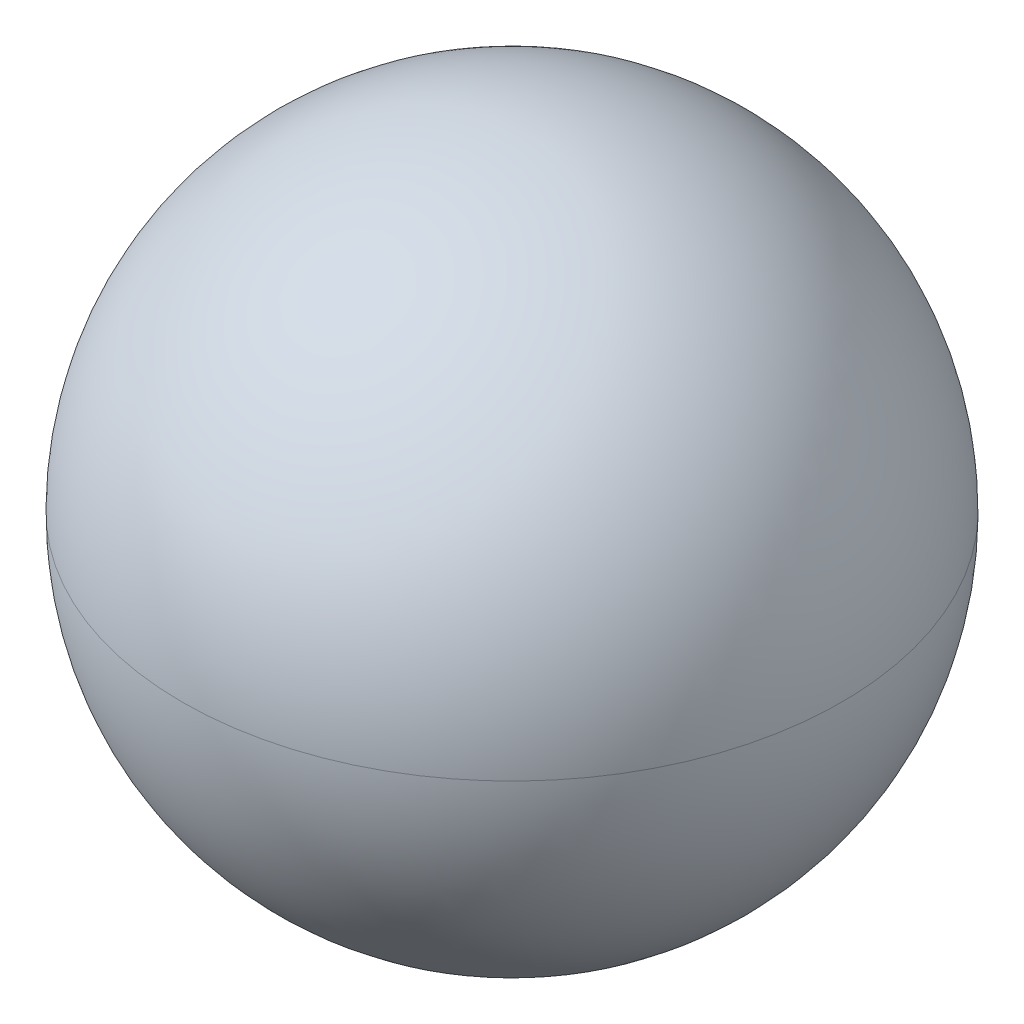
ISO-10303-21;
HEADER;
FILE_DESCRIPTION(('STEP AP214'),'2;1');
FILE_NAME('part.step','',(''),(''),'','','');
FILE_SCHEMA(('AUTOMOTIVE_DESIGN { 1 0 10303 214 1 1 1 1 }'));
ENDSEC;
DATA;
#1=APPLICATION_CONTEXT('core data for automotive mechanical design processes');
#2=APPLICATION_PROTOCOL_DEFINITION('international standard','automotive_design',2000,#1);
#3=PRODUCT_CONTEXT('',#1,'mechanical');
#4=PRODUCT('Part','Part','',(#3));
#5=PRODUCT_RELATED_PRODUCT_CATEGORY('part','',(#4));
#6=PRODUCT_DEFINITION_FORMATION('','',#4);
#7=PRODUCT_DEFINITION_CONTEXT('part definition',#1,'design');
#8=PRODUCT_DEFINITION('design','',#6,#7);
#9=PRODUCT_DEFINITION_SHAPE('','',#8);
#10=(LENGTH_UNIT() NAMED_UNIT(*) SI_UNIT(.MILLI.,.METRE.));
#11=(NAMED_UNIT(*) PLANE_ANGLE_UNIT() SI_UNIT($,.RADIAN.));
#12=(NAMED_UNIT(*) SI_UNIT($,.STERADIAN.) SOLID_ANGLE_UNIT());
#13=UNCERTAINTY_MEASURE_WITH_UNIT(LENGTH_MEASURE(1.E-05),#10,'distance_accuracy_value','');
#14=(GEOMETRIC_REPRESENTATION_CONTEXT(3) GLOBAL_UNCERTAINTY_ASSIGNED_CONTEXT((#13)) GLOBAL_UNIT_ASSIGNED_CONTEXT((#10,
#11,#12)) REPRESENTATION_CONTEXT('',''));
#15=CARTESIAN_POINT('',(0.,0.,0.));
#16=DIRECTION('',(0.,0.,1.));
#17=DIRECTION('',(1.,0.,0.));
#18=AXIS2_PLACEMENT_3D('',#15,#16,#17);
#19=CARTESIAN_POINT('',(0.,88.9,0.));
#20=DIRECTION('',(0.,1.,0.));
#21=DIRECTION('',(0.,0.,1.));
#22=AXIS2_PLACEMENT_3D('',#19,#20,#21);
#23=SPHERICAL_SURFACE('',#22,88.9);
#24=CARTESIAN_POINT('',(0.,88.9,0.));
#25=DIRECTION('',(0.,-1.,0.));
#26=DIRECTION('',(0.,0.,-1.));
#27=AXIS2_PLACEMENT_3D('',#24,#25,#26);
#28=CIRCLE('',#27,88.9);
#29=CARTESIAN_POINT('',(0.,88.9,-88.9));
#30=VERTEX_POINT('',#29);
#31=EDGE_CURVE('E10',#30,#30,#28,.T.);
#32=ORIENTED_EDGE('',*,*,#31,.F.);
#33=EDGE_LOOP('',(#32));
#34=FACE_BOUND('',#33,.T.);
#35=ADVANCED_FACE('F37',(#34),#23,.T.);
#36=CARTESIAN_POINT('',(0.,88.9,0.));
#37=DIRECTION('',(0.,1.,0.));
#38=DIRECTION('',(0.,0.,1.));
#39=AXIS2_PLACEMENT_3D('',#36,#37,#38);
#40=SPHERICAL_SURFACE('',#39,88.9);
#41=ORIENTED_EDGE('',*,*,#31,.T.);
#42=EDGE_LOOP('',(#41));
#43=FACE_BOUND('',#42,.T.);
#44=ADVANCED_FACE('F39',(#43),#40,.T.);
#45=CLOSED_SHELL('',(#35,#44));
#46=MANIFOLD_SOLID_BREP('B2',#45);
#47=ADVANCED_BREP_SHAPE_REPRESENTATION('',(#18,#46),#14);
#48=SHAPE_DEFINITION_REPRESENTATION(#9,#47);
ENDSEC;
END-ISO-10303-21;
